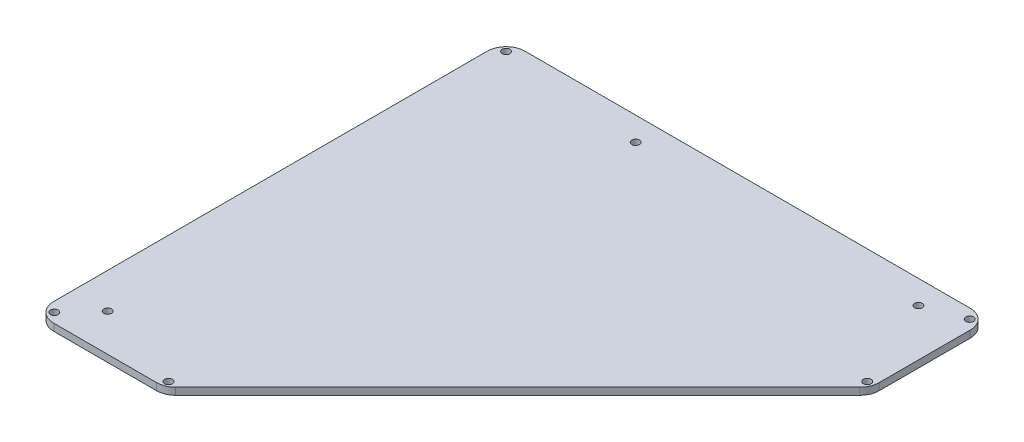
ISO-10303-21;
HEADER;
FILE_DESCRIPTION(('STEP AP214'),'2;1');
FILE_NAME('part.step','',(''),(''),'','','');
FILE_SCHEMA(('AUTOMOTIVE_DESIGN { 1 0 10303 214 1 1 1 1 }'));
ENDSEC;
DATA;
#1=APPLICATION_CONTEXT('core data for automotive mechanical design processes');
#2=APPLICATION_PROTOCOL_DEFINITION('international standard','automotive_design',2000,#1);
#3=PRODUCT_CONTEXT('',#1,'mechanical');
#4=PRODUCT('Part','Part','',(#3));
#5=PRODUCT_RELATED_PRODUCT_CATEGORY('part','',(#4));
#6=PRODUCT_DEFINITION_FORMATION('','',#4);
#7=PRODUCT_DEFINITION_CONTEXT('part definition',#1,'design');
#8=PRODUCT_DEFINITION('design','',#6,#7);
#9=PRODUCT_DEFINITION_SHAPE('','',#8);
#10=(LENGTH_UNIT() NAMED_UNIT(*) SI_UNIT(.MILLI.,.METRE.));
#11=(NAMED_UNIT(*) PLANE_ANGLE_UNIT() SI_UNIT($,.RADIAN.));
#12=(NAMED_UNIT(*) SI_UNIT($,.STERADIAN.) SOLID_ANGLE_UNIT());
#13=UNCERTAINTY_MEASURE_WITH_UNIT(LENGTH_MEASURE(1.E-05),#10,'distance_accuracy_value','');
#14=(GEOMETRIC_REPRESENTATION_CONTEXT(3) GLOBAL_UNCERTAINTY_ASSIGNED_CONTEXT((#13)) GLOBAL_UNIT_ASSIGNED_CONTEXT((#10,
#11,#12)) REPRESENTATION_CONTEXT('',''));
#15=CARTESIAN_POINT('',(0.,0.,0.));
#16=DIRECTION('',(0.,0.,1.));
#17=DIRECTION('',(1.,0.,0.));
#18=AXIS2_PLACEMENT_3D('',#15,#16,#17);
#19=CARTESIAN_POINT('',(0.,3.,0.01000000000001));
#20=DIRECTION('',(0.,1.,0.));
#21=DIRECTION('',(-1.,0.,0.));
#22=AXIS2_PLACEMENT_3D('',#19,#20,#21);
#23=PLANE('',#22);
#24=DIRECTION('',(-1.,0.,0.));
#25=VECTOR('',#24,1.);
#26=CARTESIAN_POINT('',(8.00000000000004,3.,-200.));
#27=LINE('',#26,#25);
#28=CARTESIAN_POINT('',(197.,2.99999999999999,-200.));
#29=VERTEX_POINT('',#28);
#30=CARTESIAN_POINT('',(8.00000000000006,2.99999999999999,-200.));
#31=VERTEX_POINT('',#30);
#32=EDGE_CURVE('E117',#29,#31,#27,.T.);
#33=ORIENTED_EDGE('',*,*,#32,.T.);
#34=CARTESIAN_POINT('',(8.,3.,-192.));
#35=DIRECTION('',(0.,1.,0.));
#36=DIRECTION('',(-1.,0.,0.));
#37=AXIS2_PLACEMENT_3D('',#34,#35,#36);
#38=CIRCLE('',#37,8.);
#39=CARTESIAN_POINT('',(0.,3.,-192.));
#40=VERTEX_POINT('',#39);
#41=EDGE_CURVE('E125',#31,#40,#38,.T.);
#42=ORIENTED_EDGE('',*,*,#41,.T.);
#43=DIRECTION('',(0.,0.,1.));
#44=VECTOR('',#43,1.);
#45=CARTESIAN_POINT('',(0.,3.,-8.00000000000006));
#46=LINE('',#45,#44);
#47=CARTESIAN_POINT('',(0.,3.,-8.00000000000006));
#48=VERTEX_POINT('',#47);
#49=EDGE_CURVE('E129',#40,#48,#46,.T.);
#50=ORIENTED_EDGE('',*,*,#49,.T.);
#51=CARTESIAN_POINT('',(8.,3.,-8.));
#52=DIRECTION('',(0.,1.,0.));
#53=DIRECTION('',(-1.,0.,0.));
#54=AXIS2_PLACEMENT_3D('',#51,#52,#53);
#55=CIRCLE('',#54,8.);
#56=CARTESIAN_POINT('',(8.,3.,0.));
#57=VERTEX_POINT('',#56);
#58=EDGE_CURVE('E251',#48,#57,#55,.T.);
#59=ORIENTED_EDGE('',*,*,#58,.T.);
#60=DIRECTION('',(1.,0.,0.));
#61=VECTOR('',#60,1.);
#62=CARTESIAN_POINT('',(51.6862915010151,3.,0.));
#63=LINE('',#62,#61);
#64=CARTESIAN_POINT('',(51.6862915010151,3.,0.));
#65=VERTEX_POINT('',#64);
#66=EDGE_CURVE('E254',#57,#65,#63,.T.);
#67=ORIENTED_EDGE('',*,*,#66,.T.);
#68=CARTESIAN_POINT('',(51.6862915010152,3.,-8.));
#69=DIRECTION('',(0.,1.,0.));
#70=DIRECTION('',(-1.,0.,0.));
#71=AXIS2_PLACEMENT_3D('',#68,#69,#70);
#72=CIRCLE('',#71,8.);
#73=CARTESIAN_POINT('',(57.3431457505076,2.99999999999999,-2.34314575050764));
#74=VERTEX_POINT('',#73);
#75=EDGE_CURVE('E257',#65,#74,#72,.T.);
#76=ORIENTED_EDGE('',*,*,#75,.T.);
#77=DIRECTION('',(0.707106781186547,0.,-0.707106781186548));
#78=VECTOR('',#77,1.);
#79=CARTESIAN_POINT('',(202.656854249492,2.99999999999998,-147.656854249492));
#80=LINE('',#79,#78);
#81=CARTESIAN_POINT('',(202.656854249492,2.99999999999998,-147.656854249492));
#82=VERTEX_POINT('',#81);
#83=EDGE_CURVE('E260',#74,#82,#80,.T.);
#84=ORIENTED_EDGE('',*,*,#83,.T.);
#85=CARTESIAN_POINT('',(197.,2.99999999999998,-153.313708498985));
#86=DIRECTION('',(0.,1.,0.));
#87=DIRECTION('',(-1.,0.,0.));
#88=AXIS2_PLACEMENT_3D('',#85,#86,#87);
#89=CIRCLE('',#88,8.00000000000001);
#90=CARTESIAN_POINT('',(205.,2.99999999999998,-153.313708498985));
#91=VERTEX_POINT('',#90);
#92=EDGE_CURVE('E263',#82,#91,#89,.T.);
#93=ORIENTED_EDGE('',*,*,#92,.T.);
#94=DIRECTION('',(0.,0.,-1.));
#95=VECTOR('',#94,1.);
#96=CARTESIAN_POINT('',(205.,2.99999999999998,0.01000000000001));
#97=LINE('',#96,#95);
#98=CARTESIAN_POINT('',(205.,2.99999999999998,-192.));
#99=VERTEX_POINT('',#98);
#100=EDGE_CURVE('E138',#91,#99,#97,.T.);
#101=ORIENTED_EDGE('',*,*,#100,.T.);
#102=CARTESIAN_POINT('',(197.,2.99999999999998,-192.));
#103=DIRECTION('',(0.,1.,0.));
#104=DIRECTION('',(-1.,0.,0.));
#105=AXIS2_PLACEMENT_3D('',#102,#103,#104);
#106=CIRCLE('',#105,8.00000000000001);
#107=EDGE_CURVE('E135',#99,#29,#106,.T.);
#108=ORIENTED_EDGE('',*,*,#107,.T.);
#109=EDGE_LOOP('',(#33,#42,#50,#59,#67,#76,#84,#93,#101,#108));
#110=FACE_BOUND('',#109,.T.);
#111=CARTESIAN_POINT('',(4.11091270347399,3.,-4.11091270347399));
#112=DIRECTION('',(0.,1.,0.));
#113=DIRECTION('',(-1.,0.,0.));
#114=AXIS2_PLACEMENT_3D('',#111,#112,#113);
#115=CIRCLE('',#114,1.64999999999999);
#116=CARTESIAN_POINT('',(2.460912703474,3.,-4.11091270347399));
#117=VERTEX_POINT('',#116);
#118=EDGE_CURVE('E141',#117,#117,#115,.F.);
#119=ORIENTED_EDGE('',*,*,#118,.T.);
#120=EDGE_LOOP('',(#119));
#121=FACE_BOUND('',#120,.T.);
#122=CARTESIAN_POINT('',(200.889087296526,2.99999999999998,-195.889087296526));
#123=DIRECTION('',(0.,1.,0.));
#124=DIRECTION('',(-1.,0.,0.));
#125=AXIS2_PLACEMENT_3D('',#122,#123,#124);
#126=CIRCLE('',#125,1.64999999999998);
#127=CARTESIAN_POINT('',(199.239087296526,2.99999999999998,-195.889087296526));
#128=VERTEX_POINT('',#127);
#129=EDGE_CURVE('E150',#128,#128,#126,.F.);
#130=ORIENTED_EDGE('',*,*,#129,.T.);
#131=EDGE_LOOP('',(#130));
#132=FACE_BOUND('',#131,.T.);
#133=CARTESIAN_POINT('',(202.081337428812,2.99999999999998,-151.208949620977));
#134=DIRECTION('',(0.,1.,0.));
#135=DIRECTION('',(-1.,0.,0.));
#136=AXIS2_PLACEMENT_3D('',#133,#134,#135);
#137=CIRCLE('',#136,1.64999999999998);
#138=CARTESIAN_POINT('',(200.431337428812,2.99999999999998,-151.208949620977));
#139=VERTEX_POINT('',#138);
#140=EDGE_CURVE('E153',#139,#139,#137,.F.);
#141=ORIENTED_EDGE('',*,*,#140,.T.);
#142=EDGE_LOOP('',(#141));
#143=FACE_BOUND('',#142,.T.);
#144=CARTESIAN_POINT('',(4.11091270347398,3.,-195.889087296526));
#145=DIRECTION('',(0.,1.,0.));
#146=DIRECTION('',(-1.,0.,0.));
#147=AXIS2_PLACEMENT_3D('',#144,#145,#146);
#148=CIRCLE('',#147,1.64999999999999);
#149=CARTESIAN_POINT('',(2.46091270347399,3.,-195.889087296526));
#150=VERTEX_POINT('',#149);
#151=EDGE_CURVE('E147',#150,#150,#148,.F.);
#152=ORIENTED_EDGE('',*,*,#151,.T.);
#153=EDGE_LOOP('',(#152));
#154=FACE_BOUND('',#153,.T.);
#155=CARTESIAN_POINT('',(53.7910503790232,2.99999999999999,-2.91866257118793));
#156=DIRECTION('',(0.,1.,0.));
#157=DIRECTION('',(-1.,0.,0.));
#158=AXIS2_PLACEMENT_3D('',#155,#156,#157);
#159=CIRCLE('',#158,1.64999999999999);
#160=CARTESIAN_POINT('',(52.1410503790232,2.99999999999999,-2.91866257118793));
#161=VERTEX_POINT('',#160);
#162=EDGE_CURVE('E136',#161,#161,#159,.F.);
#163=ORIENTED_EDGE('',*,*,#162,.T.);
#164=EDGE_LOOP('',(#163));
#165=FACE_BOUND('',#164,.T.);
#166=CARTESIAN_POINT('',(15.,3.,-15.8999999999999));
#167=DIRECTION('',(0.,1.,0.));
#168=DIRECTION('',(0.,0.,1.));
#169=AXIS2_PLACEMENT_3D('',#166,#167,#168);
#170=CIRCLE('',#169,1.64999999999999);
#171=CARTESIAN_POINT('',(15.,3.,-14.2499999999999));
#172=VERTEX_POINT('',#171);
#173=EDGE_CURVE('E217',#172,#172,#170,.T.);
#174=ORIENTED_EDGE('',*,*,#173,.F.);
#175=EDGE_LOOP('',(#174));
#176=FACE_BOUND('',#175,.T.);
#177=CARTESIAN_POINT('',(65.,3.,-190.));
#178=DIRECTION('',(0.,1.,0.));
#179=DIRECTION('',(0.,0.,1.));
#180=AXIS2_PLACEMENT_3D('',#177,#178,#179);
#181=CIRCLE('',#180,1.64999999999999);
#182=CARTESIAN_POINT('',(65.,3.,-188.35));
#183=VERTEX_POINT('',#182);
#184=EDGE_CURVE('E210',#183,#183,#181,.T.);
#185=ORIENTED_EDGE('',*,*,#184,.F.);
#186=EDGE_LOOP('',(#185));
#187=FACE_BOUND('',#186,.T.);
#188=CARTESIAN_POINT('',(185.,3.,-190.));
#189=DIRECTION('',(0.,1.,0.));
#190=DIRECTION('',(0.,0.,1.));
#191=AXIS2_PLACEMENT_3D('',#188,#189,#190);
#192=CIRCLE('',#191,1.64999999999998);
#193=CARTESIAN_POINT('',(185.,3.,-188.35));
#194=VERTEX_POINT('',#193);
#195=EDGE_CURVE('E183',#194,#194,#192,.T.);
#196=ORIENTED_EDGE('',*,*,#195,.F.);
#197=EDGE_LOOP('',(#196));
#198=FACE_BOUND('',#197,.T.);
#199=ADVANCED_FACE('F35',(#110,#121,#132,#143,#154,#165,#176,#187,#198),#23,.T.);
#200=CARTESIAN_POINT('',(8.,0.,-192.));
#201=DIRECTION('',(0.,-1.,0.));
#202=DIRECTION('',(0.,0.,-1.));
#203=AXIS2_PLACEMENT_3D('',#200,#201,#202);
#204=PLANE('',#203);
#205=CARTESIAN_POINT('',(202.081337428812,0.,-151.208949620977));
#206=DIRECTION('',(0.,-1.,0.));
#207=DIRECTION('',(0.,0.,-1.));
#208=AXIS2_PLACEMENT_3D('',#205,#206,#207);
#209=CIRCLE('',#208,1.67500000000001);
#210=CARTESIAN_POINT('',(202.081337428812,0.,-152.883949620977));
#211=VERTEX_POINT('',#210);
#212=EDGE_CURVE('E11',#211,#211,#209,.T.);
#213=ORIENTED_EDGE('',*,*,#212,.F.);
#214=EDGE_LOOP('',(#213));
#215=FACE_BOUND('',#214,.T.);
#216=CARTESIAN_POINT('',(200.889087296526,0.,-195.889087296526));
#217=DIRECTION('',(0.,-1.,0.));
#218=DIRECTION('',(0.,0.,-1.));
#219=AXIS2_PLACEMENT_3D('',#216,#217,#218);
#220=CIRCLE('',#219,1.67500000000001);
#221=CARTESIAN_POINT('',(200.889087296526,0.,-197.564087296526));
#222=VERTEX_POINT('',#221);
#223=EDGE_CURVE('E245',#222,#222,#220,.T.);
#224=ORIENTED_EDGE('',*,*,#223,.F.);
#225=EDGE_LOOP('',(#224));
#226=FACE_BOUND('',#225,.T.);
#227=CARTESIAN_POINT('',(4.11091270347398,0.,-195.889087296526));
#228=DIRECTION('',(0.,-1.,0.));
#229=DIRECTION('',(0.,0.,-1.));
#230=AXIS2_PLACEMENT_3D('',#227,#228,#229);
#231=CIRCLE('',#230,1.675);
#232=CARTESIAN_POINT('',(4.11091270347398,0.,-197.564087296526));
#233=VERTEX_POINT('',#232);
#234=EDGE_CURVE('E239',#233,#233,#231,.T.);
#235=ORIENTED_EDGE('',*,*,#234,.F.);
#236=EDGE_LOOP('',(#235));
#237=FACE_BOUND('',#236,.T.);
#238=CARTESIAN_POINT('',(4.11091270347399,0.,-4.11091270347399));
#239=DIRECTION('',(0.,-1.,0.));
#240=DIRECTION('',(0.,0.,-1.));
#241=AXIS2_PLACEMENT_3D('',#238,#239,#240);
#242=CIRCLE('',#241,1.675);
#243=CARTESIAN_POINT('',(4.11091270347399,0.,-5.78591270347399));
#244=VERTEX_POINT('',#243);
#245=EDGE_CURVE('E233',#244,#244,#242,.T.);
#246=ORIENTED_EDGE('',*,*,#245,.F.);
#247=EDGE_LOOP('',(#246));
#248=FACE_BOUND('',#247,.T.);
#249=CARTESIAN_POINT('',(53.7910503790232,0.,-2.91866257118793));
#250=DIRECTION('',(0.,-1.,0.));
#251=DIRECTION('',(0.,0.,-1.));
#252=AXIS2_PLACEMENT_3D('',#249,#250,#251);
#253=CIRCLE('',#252,1.675);
#254=CARTESIAN_POINT('',(53.7910503790232,0.,-4.59366257118792));
#255=VERTEX_POINT('',#254);
#256=EDGE_CURVE('E227',#255,#255,#253,.T.);
#257=ORIENTED_EDGE('',*,*,#256,.F.);
#258=EDGE_LOOP('',(#257));
#259=FACE_BOUND('',#258,.T.);
#260=CARTESIAN_POINT('',(15.,0.,-15.8999999999999));
#261=DIRECTION('',(0.,-1.,0.));
#262=DIRECTION('',(0.,0.,-1.));
#263=AXIS2_PLACEMENT_3D('',#260,#261,#262);
#264=CIRCLE('',#263,1.675);
#265=CARTESIAN_POINT('',(15.,0.,-17.5749999999999));
#266=VERTEX_POINT('',#265);
#267=EDGE_CURVE('E221',#266,#266,#264,.T.);
#268=ORIENTED_EDGE('',*,*,#267,.F.);
#269=EDGE_LOOP('',(#268));
#270=FACE_BOUND('',#269,.T.);
#271=CARTESIAN_POINT('',(65.,0.,-190.));
#272=DIRECTION('',(0.,-1.,0.));
#273=DIRECTION('',(0.,0.,-1.));
#274=AXIS2_PLACEMENT_3D('',#271,#272,#273);
#275=CIRCLE('',#274,1.675);
#276=CARTESIAN_POINT('',(65.,0.,-191.675));
#277=VERTEX_POINT('',#276);
#278=EDGE_CURVE('E214',#277,#277,#275,.T.);
#279=ORIENTED_EDGE('',*,*,#278,.F.);
#280=EDGE_LOOP('',(#279));
#281=FACE_BOUND('',#280,.T.);
#282=CARTESIAN_POINT('',(185.,0.,-190.));
#283=DIRECTION('',(0.,-1.,0.));
#284=DIRECTION('',(0.,0.,-1.));
#285=AXIS2_PLACEMENT_3D('',#282,#283,#284);
#286=CIRCLE('',#285,1.67500000000001);
#287=CARTESIAN_POINT('',(185.,0.,-191.675));
#288=VERTEX_POINT('',#287);
#289=EDGE_CURVE('E207',#288,#288,#286,.T.);
#290=ORIENTED_EDGE('',*,*,#289,.F.);
#291=EDGE_LOOP('',(#290));
#292=FACE_BOUND('',#291,.T.);
#293=CARTESIAN_POINT('',(8.,0.,-192.));
#294=DIRECTION('',(0.,1.,0.));
#295=DIRECTION('',(0.,0.,-1.));
#296=AXIS2_PLACEMENT_3D('',#293,#294,#295);
#297=CIRCLE('',#296,8.);
#298=CARTESIAN_POINT('',(8.00000000000006,0.,-200.));
#299=VERTEX_POINT('',#298);
#300=CARTESIAN_POINT('',(0.,0.,-192.));
#301=VERTEX_POINT('',#300);
#302=EDGE_CURVE('E180',#299,#301,#297,.T.);
#303=ORIENTED_EDGE('',*,*,#302,.F.);
#304=DIRECTION('',(-1.,0.,0.));
#305=VECTOR('',#304,1.);
#306=CARTESIAN_POINT('',(8.00000000000006,0.,-200.));
#307=LINE('',#306,#305);
#308=CARTESIAN_POINT('',(197.,0.,-200.));
#309=VERTEX_POINT('',#308);
#310=EDGE_CURVE('E119',#309,#299,#307,.T.);
#311=ORIENTED_EDGE('',*,*,#310,.F.);
#312=CARTESIAN_POINT('',(197.,0.,-192.));
#313=DIRECTION('',(0.,1.,0.));
#314=DIRECTION('',(0.,0.,-1.));
#315=AXIS2_PLACEMENT_3D('',#312,#313,#314);
#316=CIRCLE('',#315,8.00000000000001);
#317=CARTESIAN_POINT('',(205.,0.,-192.));
#318=VERTEX_POINT('',#317);
#319=EDGE_CURVE('E172',#318,#309,#316,.T.);
#320=ORIENTED_EDGE('',*,*,#319,.F.);
#321=DIRECTION('',(0.,0.,-1.));
#322=VECTOR('',#321,1.);
#323=CARTESIAN_POINT('',(205.,0.,-192.));
#324=LINE('',#323,#322);
#325=CARTESIAN_POINT('',(205.,0.,-153.313708498985));
#326=VERTEX_POINT('',#325);
#327=EDGE_CURVE('E177',#326,#318,#324,.T.);
#328=ORIENTED_EDGE('',*,*,#327,.F.);
#329=CARTESIAN_POINT('',(197.,0.,-153.313708498985));
#330=DIRECTION('',(0.,1.,0.));
#331=DIRECTION('',(0.,0.,-1.));
#332=AXIS2_PLACEMENT_3D('',#329,#330,#331);
#333=CIRCLE('',#332,8.00000000000001);
#334=CARTESIAN_POINT('',(202.656854249492,0.,-147.656854249492));
#335=VERTEX_POINT('',#334);
#336=EDGE_CURVE('E187',#335,#326,#333,.T.);
#337=ORIENTED_EDGE('',*,*,#336,.F.);
#338=DIRECTION('',(0.707106781186547,0.,-0.707106781186548));
#339=VECTOR('',#338,1.);
#340=CARTESIAN_POINT('',(202.656854249492,0.,-147.656854249492));
#341=LINE('',#340,#339);
#342=CARTESIAN_POINT('',(57.3431457505076,0.,-2.34314575050764));
#343=VERTEX_POINT('',#342);
#344=EDGE_CURVE('E190',#343,#335,#341,.T.);
#345=ORIENTED_EDGE('',*,*,#344,.F.);
#346=CARTESIAN_POINT('',(51.6862915010152,0.,-8.));
#347=DIRECTION('',(0.,1.,0.));
#348=DIRECTION('',(0.,0.,-1.));
#349=AXIS2_PLACEMENT_3D('',#346,#347,#348);
#350=CIRCLE('',#349,8.);
#351=CARTESIAN_POINT('',(51.6862915010151,0.,0.));
#352=VERTEX_POINT('',#351);
#353=EDGE_CURVE('E193',#352,#343,#350,.T.);
#354=ORIENTED_EDGE('',*,*,#353,.F.);
#355=DIRECTION('',(1.,0.,0.));
#356=VECTOR('',#355,1.);
#357=CARTESIAN_POINT('',(51.6862915010151,0.,0.));
#358=LINE('',#357,#356);
#359=CARTESIAN_POINT('',(8.,0.,0.));
#360=VERTEX_POINT('',#359);
#361=EDGE_CURVE('E196',#360,#352,#358,.T.);
#362=ORIENTED_EDGE('',*,*,#361,.F.);
#363=CARTESIAN_POINT('',(8.,0.,-8.));
#364=DIRECTION('',(0.,1.,0.));
#365=DIRECTION('',(0.,0.,1.));
#366=AXIS2_PLACEMENT_3D('',#363,#364,#365);
#367=CIRCLE('',#366,8.);
#368=CARTESIAN_POINT('',(0.,0.,-8.00000000000006));
#369=VERTEX_POINT('',#368);
#370=EDGE_CURVE('E199',#369,#360,#367,.T.);
#371=ORIENTED_EDGE('',*,*,#370,.F.);
#372=DIRECTION('',(0.,0.,1.));
#373=VECTOR('',#372,1.);
#374=CARTESIAN_POINT('',(0.,0.,-8.00000000000006));
#375=LINE('',#374,#373);
#376=EDGE_CURVE('E201',#301,#369,#375,.T.);
#377=ORIENTED_EDGE('',*,*,#376,.F.);
#378=EDGE_LOOP('',(#303,#311,#320,#328,#337,#345,#354,#362,#371,#377));
#379=FACE_BOUND('',#378,.T.);
#380=ADVANCED_FACE('F179',(#215,#226,#237,#248,#259,#270,#281,#292,#379),#204,.T.);
#381=CARTESIAN_POINT('',(202.081337428812,0.,-151.208949620977));
#382=DIRECTION('',(0.,-1.,0.));
#383=DIRECTION('',(0.,0.,-1.));
#384=AXIS2_PLACEMENT_3D('',#381,#382,#383);
#385=CYLINDRICAL_SURFACE('',#384,1.64999999999998);
#386=CARTESIAN_POINT('',(202.081337428812,0.0250000000000111,-151.208949620977));
#387=DIRECTION('',(0.,-1.,0.));
#388=DIRECTION('',(0.,0.,-1.));
#389=AXIS2_PLACEMENT_3D('',#386,#387,#388);
#390=CIRCLE('',#389,1.64999999999998);
#391=CARTESIAN_POINT('',(202.081337428812,0.0250000000000111,-152.858949620977));
#392=VERTEX_POINT('',#391);
#393=EDGE_CURVE('E44',#392,#392,#390,.T.);
#394=ORIENTED_EDGE('',*,*,#393,.T.);
#395=EDGE_LOOP('',(#394));
#396=FACE_BOUND('',#395,.T.);
#397=ORIENTED_EDGE('',*,*,#140,.F.);
#398=EDGE_LOOP('',(#397));
#399=FACE_BOUND('',#398,.T.);
#400=ADVANCED_FACE('F295',(#396,#399),#385,.F.);
#401=CARTESIAN_POINT('',(202.081337428812,0.,-151.208949620977));
#402=DIRECTION('',(0.,-1.,0.));
#403=DIRECTION('',(0.,0.,-1.));
#404=AXIS2_PLACEMENT_3D('',#401,#402,#403);
#405=CONICAL_SURFACE('',#404,1.67500000000001,0.785398163397691);
#406=ORIENTED_EDGE('',*,*,#393,.F.);
#407=EDGE_LOOP('',(#406));
#408=FACE_BOUND('',#407,.T.);
#409=ORIENTED_EDGE('',*,*,#212,.T.);
#410=EDGE_LOOP('',(#409));
#411=FACE_BOUND('',#410,.T.);
#412=ADVANCED_FACE('F297',(#408,#411),#405,.F.);
#413=CARTESIAN_POINT('',(200.889087296526,0.,-195.889087296526));
#414=DIRECTION('',(0.,-1.,0.));
#415=DIRECTION('',(0.,0.,-1.));
#416=AXIS2_PLACEMENT_3D('',#413,#414,#415);
#417=CYLINDRICAL_SURFACE('',#416,1.64999999999998);
#418=CARTESIAN_POINT('',(200.889087296526,0.0250000000000111,-195.889087296526));
#419=DIRECTION('',(0.,-1.,0.));
#420=DIRECTION('',(0.,0.,-1.));
#421=AXIS2_PLACEMENT_3D('',#418,#419,#420);
#422=CIRCLE('',#421,1.64999999999998);
#423=CARTESIAN_POINT('',(200.889087296526,0.0250000000000111,-197.539087296526));
#424=VERTEX_POINT('',#423);
#425=EDGE_CURVE('E242',#424,#424,#422,.T.);
#426=ORIENTED_EDGE('',*,*,#425,.T.);
#427=EDGE_LOOP('',(#426));
#428=FACE_BOUND('',#427,.T.);
#429=ORIENTED_EDGE('',*,*,#129,.F.);
#430=EDGE_LOOP('',(#429));
#431=FACE_BOUND('',#430,.T.);
#432=ADVANCED_FACE('F304',(#428,#431),#417,.F.);
#433=CARTESIAN_POINT('',(200.889087296526,0.,-195.889087296526));
#434=DIRECTION('',(0.,-1.,0.));
#435=DIRECTION('',(0.,0.,-1.));
#436=AXIS2_PLACEMENT_3D('',#433,#434,#435);
#437=CONICAL_SURFACE('',#436,1.67500000000001,0.785398163397691);
#438=ORIENTED_EDGE('',*,*,#425,.F.);
#439=EDGE_LOOP('',(#438));
#440=FACE_BOUND('',#439,.T.);
#441=ORIENTED_EDGE('',*,*,#223,.T.);
#442=EDGE_LOOP('',(#441));
#443=FACE_BOUND('',#442,.T.);
#444=ADVANCED_FACE('F314',(#440,#443),#437,.F.);
#445=CARTESIAN_POINT('',(4.11091270347398,0.,-195.889087296526));
#446=DIRECTION('',(0.,-1.,0.));
#447=DIRECTION('',(0.,0.,-1.));
#448=AXIS2_PLACEMENT_3D('',#445,#446,#447);
#449=CYLINDRICAL_SURFACE('',#448,1.64999999999999);
#450=CARTESIAN_POINT('',(4.11091270347398,0.0250000000000111,-195.889087296526));
#451=DIRECTION('',(0.,-1.,0.));
#452=DIRECTION('',(0.,0.,-1.));
#453=AXIS2_PLACEMENT_3D('',#450,#451,#452);
#454=CIRCLE('',#453,1.64999999999999);
#455=CARTESIAN_POINT('',(4.11091270347398,0.0250000000000111,-197.539087296526));
#456=VERTEX_POINT('',#455);
#457=EDGE_CURVE('E236',#456,#456,#454,.T.);
#458=ORIENTED_EDGE('',*,*,#457,.T.);
#459=EDGE_LOOP('',(#458));
#460=FACE_BOUND('',#459,.T.);
#461=ORIENTED_EDGE('',*,*,#151,.F.);
#462=EDGE_LOOP('',(#461));
#463=FACE_BOUND('',#462,.T.);
#464=ADVANCED_FACE('F316',(#460,#463),#449,.F.);
#465=CARTESIAN_POINT('',(4.11091270347398,0.,-195.889087296526));
#466=DIRECTION('',(0.,-1.,0.));
#467=DIRECTION('',(0.,0.,-1.));
#468=AXIS2_PLACEMENT_3D('',#465,#466,#467);
#469=CONICAL_SURFACE('',#468,1.675,0.785398163397379);
#470=ORIENTED_EDGE('',*,*,#457,.F.);
#471=EDGE_LOOP('',(#470));
#472=FACE_BOUND('',#471,.T.);
#473=ORIENTED_EDGE('',*,*,#234,.T.);
#474=EDGE_LOOP('',(#473));
#475=FACE_BOUND('',#474,.T.);
#476=ADVANCED_FACE('F319',(#472,#475),#469,.F.);
#477=CARTESIAN_POINT('',(4.11091270347399,0.,-4.11091270347399));
#478=DIRECTION('',(0.,-1.,0.));
#479=DIRECTION('',(0.,0.,-1.));
#480=AXIS2_PLACEMENT_3D('',#477,#478,#479);
#481=CYLINDRICAL_SURFACE('',#480,1.64999999999999);
#482=CARTESIAN_POINT('',(4.11091270347399,0.0250000000000111,-4.11091270347399));
#483=DIRECTION('',(0.,-1.,0.));
#484=DIRECTION('',(0.,0.,-1.));
#485=AXIS2_PLACEMENT_3D('',#482,#483,#484);
#486=CIRCLE('',#485,1.64999999999999);
#487=CARTESIAN_POINT('',(4.11091270347399,0.0250000000000111,-5.76091270347398));
#488=VERTEX_POINT('',#487);
#489=EDGE_CURVE('E230',#488,#488,#486,.T.);
#490=ORIENTED_EDGE('',*,*,#489,.T.);
#491=EDGE_LOOP('',(#490));
#492=FACE_BOUND('',#491,.T.);
#493=ORIENTED_EDGE('',*,*,#118,.F.);
#494=EDGE_LOOP('',(#493));
#495=FACE_BOUND('',#494,.T.);
#496=ADVANCED_FACE('F321',(#492,#495),#481,.F.);
#497=CARTESIAN_POINT('',(4.11091270347399,0.,-4.11091270347399));
#498=DIRECTION('',(0.,-1.,0.));
#499=DIRECTION('',(0.,0.,-1.));
#500=AXIS2_PLACEMENT_3D('',#497,#498,#499);
#501=CONICAL_SURFACE('',#500,1.675,0.785398163397379);
#502=ORIENTED_EDGE('',*,*,#489,.F.);
#503=EDGE_LOOP('',(#502));
#504=FACE_BOUND('',#503,.T.);
#505=ORIENTED_EDGE('',*,*,#245,.T.);
#506=EDGE_LOOP('',(#505));
#507=FACE_BOUND('',#506,.T.);
#508=ADVANCED_FACE('F324',(#504,#507),#501,.F.);
#509=CARTESIAN_POINT('',(53.7910503790232,0.,-2.91866257118793));
#510=DIRECTION('',(0.,-1.,0.));
#511=DIRECTION('',(0.,0.,-1.));
#512=AXIS2_PLACEMENT_3D('',#509,#510,#511);
#513=CYLINDRICAL_SURFACE('',#512,1.64999999999999);
#514=CARTESIAN_POINT('',(53.7910503790232,0.0250000000000111,-2.91866257118793));
#515=DIRECTION('',(0.,-1.,0.));
#516=DIRECTION('',(0.,0.,-1.));
#517=AXIS2_PLACEMENT_3D('',#514,#515,#516);
#518=CIRCLE('',#517,1.64999999999999);
#519=CARTESIAN_POINT('',(53.7910503790232,0.0250000000000111,-4.56866257118792));
#520=VERTEX_POINT('',#519);
#521=EDGE_CURVE('E224',#520,#520,#518,.T.);
#522=ORIENTED_EDGE('',*,*,#521,.T.);
#523=EDGE_LOOP('',(#522));
#524=FACE_BOUND('',#523,.T.);
#525=ORIENTED_EDGE('',*,*,#162,.F.);
#526=EDGE_LOOP('',(#525));
#527=FACE_BOUND('',#526,.T.);
#528=ADVANCED_FACE('F326',(#524,#527),#513,.F.);
#529=CARTESIAN_POINT('',(53.7910503790232,0.,-2.91866257118793));
#530=DIRECTION('',(0.,-1.,0.));
#531=DIRECTION('',(0.,0.,-1.));
#532=AXIS2_PLACEMENT_3D('',#529,#530,#531);
#533=CONICAL_SURFACE('',#532,1.675,0.785398163397275);
#534=ORIENTED_EDGE('',*,*,#521,.F.);
#535=EDGE_LOOP('',(#534));
#536=FACE_BOUND('',#535,.T.);
#537=ORIENTED_EDGE('',*,*,#256,.T.);
#538=EDGE_LOOP('',(#537));
#539=FACE_BOUND('',#538,.T.);
#540=ADVANCED_FACE('F328',(#536,#539),#533,.F.);
#541=CARTESIAN_POINT('',(15.,0.,-15.8999999999999));
#542=DIRECTION('',(0.,-1.,0.));
#543=DIRECTION('',(0.,0.,-1.));
#544=AXIS2_PLACEMENT_3D('',#541,#542,#543);
#545=CYLINDRICAL_SURFACE('',#544,1.64999999999999);
#546=ORIENTED_EDGE('',*,*,#173,.T.);
#547=EDGE_LOOP('',(#546));
#548=FACE_BOUND('',#547,.T.);
#549=CARTESIAN_POINT('',(15.,0.0250000000000042,-15.8999999999999));
#550=DIRECTION('',(0.,-1.,0.));
#551=DIRECTION('',(0.,0.,-1.));
#552=AXIS2_PLACEMENT_3D('',#549,#550,#551);
#553=CIRCLE('',#552,1.64999999999999);
#554=CARTESIAN_POINT('',(15.,0.0250000000000042,-17.5499999999999));
#555=VERTEX_POINT('',#554);
#556=EDGE_CURVE('E218',#555,#555,#553,.T.);
#557=ORIENTED_EDGE('',*,*,#556,.T.);
#558=EDGE_LOOP('',(#557));
#559=FACE_BOUND('',#558,.T.);
#560=ADVANCED_FACE('F334',(#548,#559),#545,.F.);
#561=CARTESIAN_POINT('',(15.,0.,-15.8999999999999));
#562=DIRECTION('',(0.,-1.,0.));
#563=DIRECTION('',(0.,0.,-1.));
#564=AXIS2_PLACEMENT_3D('',#561,#562,#563);
#565=CONICAL_SURFACE('',#564,1.675,0.785398163397483);
#566=ORIENTED_EDGE('',*,*,#556,.F.);
#567=EDGE_LOOP('',(#566));
#568=FACE_BOUND('',#567,.T.);
#569=ORIENTED_EDGE('',*,*,#267,.T.);
#570=EDGE_LOOP('',(#569));
#571=FACE_BOUND('',#570,.T.);
#572=ADVANCED_FACE('F375',(#568,#571),#565,.F.);
#573=CARTESIAN_POINT('',(65.,0.,-190.));
#574=DIRECTION('',(0.,-1.,0.));
#575=DIRECTION('',(0.,0.,-1.));
#576=AXIS2_PLACEMENT_3D('',#573,#574,#575);
#577=CYLINDRICAL_SURFACE('',#576,1.64999999999999);
#578=ORIENTED_EDGE('',*,*,#184,.T.);
#579=EDGE_LOOP('',(#578));
#580=FACE_BOUND('',#579,.T.);
#581=CARTESIAN_POINT('',(65.,0.0250000000000042,-190.));
#582=DIRECTION('',(0.,-1.,0.));
#583=DIRECTION('',(0.,0.,-1.));
#584=AXIS2_PLACEMENT_3D('',#581,#582,#583);
#585=CIRCLE('',#584,1.65);
#586=CARTESIAN_POINT('',(65.,0.0250000000000042,-191.65));
#587=VERTEX_POINT('',#586);
#588=EDGE_CURVE('E211',#587,#587,#585,.T.);
#589=ORIENTED_EDGE('',*,*,#588,.T.);
#590=EDGE_LOOP('',(#589));
#591=FACE_BOUND('',#590,.T.);
#592=ADVANCED_FACE('F372',(#580,#591),#577,.F.);
#593=CARTESIAN_POINT('',(65.,0.,-190.));
#594=DIRECTION('',(0.,-1.,0.));
#595=DIRECTION('',(0.,0.,-1.));
#596=AXIS2_PLACEMENT_3D('',#593,#594,#595);
#597=CONICAL_SURFACE('',#596,1.675,0.785398163397275);
#598=ORIENTED_EDGE('',*,*,#588,.F.);
#599=EDGE_LOOP('',(#598));
#600=FACE_BOUND('',#599,.T.);
#601=ORIENTED_EDGE('',*,*,#278,.T.);
#602=EDGE_LOOP('',(#601));
#603=FACE_BOUND('',#602,.T.);
#604=ADVANCED_FACE('F358',(#600,#603),#597,.F.);
#605=CARTESIAN_POINT('',(185.,0.,-190.));
#606=DIRECTION('',(0.,-1.,0.));
#607=DIRECTION('',(0.,0.,-1.));
#608=AXIS2_PLACEMENT_3D('',#605,#606,#607);
#609=CYLINDRICAL_SURFACE('',#608,1.64999999999998);
#610=ORIENTED_EDGE('',*,*,#195,.T.);
#611=EDGE_LOOP('',(#610));
#612=FACE_BOUND('',#611,.T.);
#613=CARTESIAN_POINT('',(185.,0.0250000000000042,-190.));
#614=DIRECTION('',(0.,-1.,0.));
#615=DIRECTION('',(0.,0.,-1.));
#616=AXIS2_PLACEMENT_3D('',#613,#614,#615);
#617=CIRCLE('',#616,1.64999999999998);
#618=CARTESIAN_POINT('',(185.,0.0250000000000042,-191.65));
#619=VERTEX_POINT('',#618);
#620=EDGE_CURVE('E204',#619,#619,#617,.T.);
#621=ORIENTED_EDGE('',*,*,#620,.T.);
#622=EDGE_LOOP('',(#621));
#623=FACE_BOUND('',#622,.T.);
#624=ADVANCED_FACE('F354',(#612,#623),#609,.F.);
#625=CARTESIAN_POINT('',(185.,0.,-190.));
#626=DIRECTION('',(0.,-1.,0.));
#627=DIRECTION('',(0.,0.,-1.));
#628=AXIS2_PLACEMENT_3D('',#625,#626,#627);
#629=CONICAL_SURFACE('',#628,1.67500000000001,0.78539816339783);
#630=ORIENTED_EDGE('',*,*,#620,.F.);
#631=EDGE_LOOP('',(#630));
#632=FACE_BOUND('',#631,.T.);
#633=ORIENTED_EDGE('',*,*,#289,.T.);
#634=EDGE_LOOP('',(#633));
#635=FACE_BOUND('',#634,.T.);
#636=ADVANCED_FACE('F357',(#632,#635),#629,.F.);
#637=CARTESIAN_POINT('',(205.,100.,-192.));
#638=DIRECTION('',(-1.,0.,0.));
#639=DIRECTION('',(0.,0.,1.));
#640=AXIS2_PLACEMENT_3D('',#637,#638,#639);
#641=PLANE('',#640);
#642=ORIENTED_EDGE('',*,*,#100,.F.);
#643=DIRECTION('',(0.,-1.,0.));
#644=VECTOR('',#643,1.);
#645=CARTESIAN_POINT('',(205.,100.,-153.313708498985));
#646=LINE('',#645,#644);
#647=EDGE_CURVE('E166',#91,#326,#646,.T.);
#648=ORIENTED_EDGE('',*,*,#647,.T.);
#649=ORIENTED_EDGE('',*,*,#327,.T.);
#650=DIRECTION('',(0.,-1.,0.));
#651=VECTOR('',#650,1.);
#652=CARTESIAN_POINT('',(205.,100.,-192.));
#653=LINE('',#652,#651);
#654=EDGE_CURVE('E168',#99,#318,#653,.T.);
#655=ORIENTED_EDGE('',*,*,#654,.F.);
#656=EDGE_LOOP('',(#642,#648,#649,#655));
#657=FACE_BOUND('',#656,.T.);
#658=ADVANCED_FACE('F268',(#657),#641,.F.);
#659=CARTESIAN_POINT('',(8.,100.,-192.));
#660=DIRECTION('',(0.,-1.,0.));
#661=DIRECTION('',(0.,0.,-1.));
#662=AXIS2_PLACEMENT_3D('',#659,#660,#661);
#663=CYLINDRICAL_SURFACE('',#662,8.);
#664=ORIENTED_EDGE('',*,*,#41,.F.);
#665=DIRECTION('',(0.,-1.,0.));
#666=VECTOR('',#665,1.);
#667=CARTESIAN_POINT('',(8.00000000000006,100.,-200.));
#668=LINE('',#667,#666);
#669=EDGE_CURVE('E39',#31,#299,#668,.T.);
#670=ORIENTED_EDGE('',*,*,#669,.T.);
#671=ORIENTED_EDGE('',*,*,#302,.T.);
#672=DIRECTION('',(0.,-1.,0.));
#673=VECTOR('',#672,1.);
#674=CARTESIAN_POINT('',(0.,100.,-192.));
#675=LINE('',#674,#673);
#676=EDGE_CURVE('E52',#40,#301,#675,.T.);
#677=ORIENTED_EDGE('',*,*,#676,.F.);
#678=EDGE_LOOP('',(#664,#670,#671,#677));
#679=FACE_BOUND('',#678,.T.);
#680=ADVANCED_FACE('F126',(#679),#663,.T.);
#681=CARTESIAN_POINT('',(197.,100.,-192.));
#682=DIRECTION('',(0.,-1.,0.));
#683=DIRECTION('',(0.,0.,-1.));
#684=AXIS2_PLACEMENT_3D('',#681,#682,#683);
#685=CYLINDRICAL_SURFACE('',#684,8.00000000000001);
#686=ORIENTED_EDGE('',*,*,#107,.F.);
#687=ORIENTED_EDGE('',*,*,#654,.T.);
#688=ORIENTED_EDGE('',*,*,#319,.T.);
#689=DIRECTION('',(0.,-1.,0.));
#690=VECTOR('',#689,1.);
#691=CARTESIAN_POINT('',(197.,100.,-200.));
#692=LINE('',#691,#690);
#693=EDGE_CURVE('E123',#29,#309,#692,.T.);
#694=ORIENTED_EDGE('',*,*,#693,.F.);
#695=EDGE_LOOP('',(#686,#687,#688,#694));
#696=FACE_BOUND('',#695,.T.);
#697=ADVANCED_FACE('F173',(#696),#685,.T.);
#698=CARTESIAN_POINT('',(8.00000000000006,100.,-200.));
#699=DIRECTION('',(0.,0.,1.));
#700=DIRECTION('',(1.,0.,0.));
#701=AXIS2_PLACEMENT_3D('',#698,#699,#700);
#702=PLANE('',#701);
#703=ORIENTED_EDGE('',*,*,#32,.F.);
#704=ORIENTED_EDGE('',*,*,#693,.T.);
#705=ORIENTED_EDGE('',*,*,#310,.T.);
#706=ORIENTED_EDGE('',*,*,#669,.F.);
#707=EDGE_LOOP('',(#703,#704,#705,#706));
#708=FACE_BOUND('',#707,.T.);
#709=ADVANCED_FACE('F37',(#708),#702,.F.);
#710=CARTESIAN_POINT('',(0.,100.,-8.00000000000006));
#711=DIRECTION('',(1.,0.,0.));
#712=DIRECTION('',(0.,0.,-1.));
#713=AXIS2_PLACEMENT_3D('',#710,#711,#712);
#714=PLANE('',#713);
#715=ORIENTED_EDGE('',*,*,#49,.F.);
#716=ORIENTED_EDGE('',*,*,#676,.T.);
#717=ORIENTED_EDGE('',*,*,#376,.T.);
#718=DIRECTION('',(0.,-1.,0.));
#719=VECTOR('',#718,1.);
#720=CARTESIAN_POINT('',(0.,100.,-8.00000000000006));
#721=LINE('',#720,#719);
#722=EDGE_CURVE('E60',#48,#369,#721,.T.);
#723=ORIENTED_EDGE('',*,*,#722,.F.);
#724=EDGE_LOOP('',(#715,#716,#717,#723));
#725=FACE_BOUND('',#724,.T.);
#726=ADVANCED_FACE('F287',(#725),#714,.F.);
#727=CARTESIAN_POINT('',(8.,100.,-8.));
#728=DIRECTION('',(0.,-1.,0.));
#729=DIRECTION('',(0.,0.,-1.));
#730=AXIS2_PLACEMENT_3D('',#727,#728,#729);
#731=CYLINDRICAL_SURFACE('',#730,8.);
#732=ORIENTED_EDGE('',*,*,#58,.F.);
#733=ORIENTED_EDGE('',*,*,#722,.T.);
#734=ORIENTED_EDGE('',*,*,#370,.T.);
#735=DIRECTION('',(0.,-1.,0.));
#736=VECTOR('',#735,1.);
#737=CARTESIAN_POINT('',(8.,100.,0.));
#738=LINE('',#737,#736);
#739=EDGE_CURVE('E158',#57,#360,#738,.T.);
#740=ORIENTED_EDGE('',*,*,#739,.F.);
#741=EDGE_LOOP('',(#732,#733,#734,#740));
#742=FACE_BOUND('',#741,.T.);
#743=ADVANCED_FACE('F285',(#742),#731,.T.);
#744=CARTESIAN_POINT('',(51.6862915010151,100.,0.));
#745=DIRECTION('',(0.,0.,-1.));
#746=DIRECTION('',(-1.,0.,0.));
#747=AXIS2_PLACEMENT_3D('',#744,#745,#746);
#748=PLANE('',#747);
#749=ORIENTED_EDGE('',*,*,#66,.F.);
#750=ORIENTED_EDGE('',*,*,#739,.T.);
#751=ORIENTED_EDGE('',*,*,#361,.T.);
#752=DIRECTION('',(0.,-1.,0.));
#753=VECTOR('',#752,1.);
#754=CARTESIAN_POINT('',(51.6862915010151,100.,0.));
#755=LINE('',#754,#753);
#756=EDGE_CURVE('E160',#65,#352,#755,.T.);
#757=ORIENTED_EDGE('',*,*,#756,.F.);
#758=EDGE_LOOP('',(#749,#750,#751,#757));
#759=FACE_BOUND('',#758,.T.);
#760=ADVANCED_FACE('F284',(#759),#748,.F.);
#761=CARTESIAN_POINT('',(51.6862915010152,100.,-8.));
#762=DIRECTION('',(0.,-1.,0.));
#763=DIRECTION('',(0.,0.,-1.));
#764=AXIS2_PLACEMENT_3D('',#761,#762,#763);
#765=CYLINDRICAL_SURFACE('',#764,8.);
#766=ORIENTED_EDGE('',*,*,#75,.F.);
#767=ORIENTED_EDGE('',*,*,#756,.T.);
#768=ORIENTED_EDGE('',*,*,#353,.T.);
#769=DIRECTION('',(0.,-1.,0.));
#770=VECTOR('',#769,1.);
#771=CARTESIAN_POINT('',(57.3431457505076,100.,-2.34314575050764));
#772=LINE('',#771,#770);
#773=EDGE_CURVE('E162',#74,#343,#772,.T.);
#774=ORIENTED_EDGE('',*,*,#773,.F.);
#775=EDGE_LOOP('',(#766,#767,#768,#774));
#776=FACE_BOUND('',#775,.T.);
#777=ADVANCED_FACE('F279',(#776),#765,.T.);
#778=CARTESIAN_POINT('',(202.656854249492,100.,-147.656854249492));
#779=DIRECTION('',(-0.707106781186548,0.,-0.707106781186547));
#780=DIRECTION('',(-0.707106781186547,0.,0.707106781186548));
#781=AXIS2_PLACEMENT_3D('',#778,#779,#780);
#782=PLANE('',#781);
#783=ORIENTED_EDGE('',*,*,#83,.F.);
#784=ORIENTED_EDGE('',*,*,#773,.T.);
#785=ORIENTED_EDGE('',*,*,#344,.T.);
#786=DIRECTION('',(0.,-1.,0.));
#787=VECTOR('',#786,1.);
#788=CARTESIAN_POINT('',(202.656854249492,100.,-147.656854249492));
#789=LINE('',#788,#787);
#790=EDGE_CURVE('E164',#82,#335,#789,.T.);
#791=ORIENTED_EDGE('',*,*,#790,.F.);
#792=EDGE_LOOP('',(#783,#784,#785,#791));
#793=FACE_BOUND('',#792,.T.);
#794=ADVANCED_FACE('F276',(#793),#782,.F.);
#795=CARTESIAN_POINT('',(197.,100.,-153.313708498985));
#796=DIRECTION('',(0.,-1.,0.));
#797=DIRECTION('',(0.,0.,-1.));
#798=AXIS2_PLACEMENT_3D('',#795,#796,#797);
#799=CYLINDRICAL_SURFACE('',#798,8.00000000000001);
#800=ORIENTED_EDGE('',*,*,#92,.F.);
#801=ORIENTED_EDGE('',*,*,#790,.T.);
#802=ORIENTED_EDGE('',*,*,#336,.T.);
#803=ORIENTED_EDGE('',*,*,#647,.F.);
#804=EDGE_LOOP('',(#800,#801,#802,#803));
#805=FACE_BOUND('',#804,.T.);
#806=ADVANCED_FACE('F273',(#805),#799,.T.);
#807=CLOSED_SHELL('',(#199,#380,#400,#412,#432,#444,#464,#476,#496,#508,#528,#540,#560,#572,
#592,#604,#624,#636,#658,#680,#697,#709,#726,#743,#760,#777,#794,#806));
#808=MANIFOLD_SOLID_BREP('B2',#807);
#809=ADVANCED_BREP_SHAPE_REPRESENTATION('',(#18,#808),#14);
#810=SHAPE_DEFINITION_REPRESENTATION(#9,#809);
ENDSEC;
END-ISO-10303-21;
